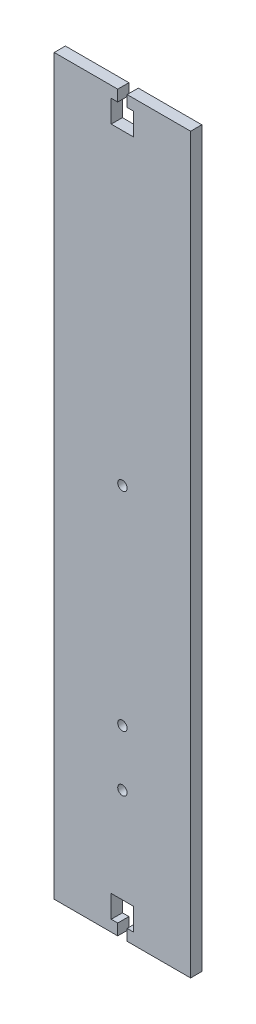
ISO-10303-21;
HEADER;
FILE_DESCRIPTION(('STEP AP214'),'2;1');
FILE_NAME('part.step','',(''),(''),'','','');
FILE_SCHEMA(('AUTOMOTIVE_DESIGN { 1 0 10303 214 1 1 1 1 }'));
ENDSEC;
DATA;
#1=APPLICATION_CONTEXT('core data for automotive mechanical design processes');
#2=APPLICATION_PROTOCOL_DEFINITION('international standard','automotive_design',2000,#1);
#3=PRODUCT_CONTEXT('',#1,'mechanical');
#4=PRODUCT('Part','Part','',(#3));
#5=PRODUCT_RELATED_PRODUCT_CATEGORY('part','',(#4));
#6=PRODUCT_DEFINITION_FORMATION('','',#4);
#7=PRODUCT_DEFINITION_CONTEXT('part definition',#1,'design');
#8=PRODUCT_DEFINITION('design','',#6,#7);
#9=PRODUCT_DEFINITION_SHAPE('','',#8);
#10=(LENGTH_UNIT() NAMED_UNIT(*) SI_UNIT(.MILLI.,.METRE.));
#11=(NAMED_UNIT(*) PLANE_ANGLE_UNIT() SI_UNIT($,.RADIAN.));
#12=(NAMED_UNIT(*) SI_UNIT($,.STERADIAN.) SOLID_ANGLE_UNIT());
#13=UNCERTAINTY_MEASURE_WITH_UNIT(LENGTH_MEASURE(1.E-05),#10,'distance_accuracy_value','');
#14=(GEOMETRIC_REPRESENTATION_CONTEXT(3) GLOBAL_UNCERTAINTY_ASSIGNED_CONTEXT((#13)) GLOBAL_UNIT_ASSIGNED_CONTEXT((#10,
#11,#12)) REPRESENTATION_CONTEXT('',''));
#15=CARTESIAN_POINT('',(0.,0.,0.));
#16=DIRECTION('',(0.,0.,1.));
#17=DIRECTION('',(1.,0.,0.));
#18=AXIS2_PLACEMENT_3D('',#15,#16,#17);
#19=CARTESIAN_POINT('',(30.505,-164.,5.));
#20=DIRECTION('',(0.,1.,0.));
#21=DIRECTION('',(-1.,0.,0.));
#22=AXIS2_PLACEMENT_3D('',#19,#20,#21);
#23=PLANE('',#22);
#24=DIRECTION('',(1.,0.,0.));
#25=VECTOR('',#24,1.);
#26=CARTESIAN_POINT('',(30.505,-164.,0.));
#27=LINE('',#26,#25);
#28=CARTESIAN_POINT('',(-30.505,-164.,0.));
#29=VERTEX_POINT('',#28);
#30=CARTESIAN_POINT('',(-2.1,-164.,0.));
#31=VERTEX_POINT('',#30);
#32=EDGE_CURVE('E215',#29,#31,#27,.T.);
#33=ORIENTED_EDGE('',*,*,#32,.T.);
#34=DIRECTION('',(0.,0.,1.));
#35=VECTOR('',#34,1.);
#36=CARTESIAN_POINT('',(-2.1,-164.,-5.));
#37=LINE('',#36,#35);
#38=CARTESIAN_POINT('',(-2.1,-164.,5.));
#39=VERTEX_POINT('',#38);
#40=EDGE_CURVE('E287',#31,#39,#37,.T.);
#41=ORIENTED_EDGE('',*,*,#40,.T.);
#42=DIRECTION('',(1.,0.,0.));
#43=VECTOR('',#42,1.);
#44=CARTESIAN_POINT('',(30.505,-164.,5.));
#45=LINE('',#44,#43);
#46=CARTESIAN_POINT('',(-30.505,-164.,5.));
#47=VERTEX_POINT('',#46);
#48=EDGE_CURVE('E194',#47,#39,#45,.T.);
#49=ORIENTED_EDGE('',*,*,#48,.F.);
#50=DIRECTION('',(0.,0.,-1.));
#51=VECTOR('',#50,1.);
#52=CARTESIAN_POINT('',(-30.505,-164.,5.));
#53=LINE('',#52,#51);
#54=EDGE_CURVE('E229',#47,#29,#53,.T.);
#55=ORIENTED_EDGE('',*,*,#54,.T.);
#56=EDGE_LOOP('',(#33,#41,#49,#55));
#57=FACE_BOUND('',#56,.T.);
#58=ADVANCED_FACE('F32',(#57),#23,.F.);
#59=CARTESIAN_POINT('',(30.505,164.,5.));
#60=DIRECTION('',(0.,-1.,0.));
#61=DIRECTION('',(1.,0.,0.));
#62=AXIS2_PLACEMENT_3D('',#59,#60,#61);
#63=PLANE('',#62);
#64=DIRECTION('',(-1.,0.,0.));
#65=VECTOR('',#64,1.);
#66=CARTESIAN_POINT('',(30.505,164.,0.));
#67=LINE('',#66,#65);
#68=CARTESIAN_POINT('',(30.505,164.,0.));
#69=VERTEX_POINT('',#68);
#70=CARTESIAN_POINT('',(2.10000000000003,164.,0.));
#71=VERTEX_POINT('',#70);
#72=EDGE_CURVE('E200',#69,#71,#67,.T.);
#73=ORIENTED_EDGE('',*,*,#72,.T.);
#74=DIRECTION('',(0.,0.,1.));
#75=VECTOR('',#74,1.);
#76=CARTESIAN_POINT('',(2.10000000000003,164.,-5.));
#77=LINE('',#76,#75);
#78=CARTESIAN_POINT('',(2.10000000000003,164.,5.));
#79=VERTEX_POINT('',#78);
#80=EDGE_CURVE('E188',#71,#79,#77,.T.);
#81=ORIENTED_EDGE('',*,*,#80,.T.);
#82=DIRECTION('',(-1.,0.,0.));
#83=VECTOR('',#82,1.);
#84=CARTESIAN_POINT('',(30.505,164.,5.));
#85=LINE('',#84,#83);
#86=CARTESIAN_POINT('',(30.505,164.,5.));
#87=VERTEX_POINT('',#86);
#88=EDGE_CURVE('E206',#87,#79,#85,.T.);
#89=ORIENTED_EDGE('',*,*,#88,.F.);
#90=DIRECTION('',(0.,0.,-1.));
#91=VECTOR('',#90,1.);
#92=CARTESIAN_POINT('',(30.505,164.,5.));
#93=LINE('',#92,#91);
#94=EDGE_CURVE('E225',#87,#69,#93,.T.);
#95=ORIENTED_EDGE('',*,*,#94,.T.);
#96=EDGE_LOOP('',(#73,#81,#89,#95));
#97=FACE_BOUND('',#96,.T.);
#98=ADVANCED_FACE('F386',(#97),#63,.F.);
#99=CARTESIAN_POINT('',(-30.505,-164.,5.));
#100=DIRECTION('',(1.,0.,0.));
#101=DIRECTION('',(0.,0.,-1.));
#102=AXIS2_PLACEMENT_3D('',#99,#100,#101);
#103=PLANE('',#102);
#104=DIRECTION('',(0.,-1.,0.));
#105=VECTOR('',#104,1.);
#106=CARTESIAN_POINT('',(-30.505,-164.,0.));
#107=LINE('',#106,#105);
#108=CARTESIAN_POINT('',(-30.505,164.,0.));
#109=VERTEX_POINT('',#108);
#110=EDGE_CURVE('E210',#109,#29,#107,.T.);
#111=ORIENTED_EDGE('',*,*,#110,.T.);
#112=ORIENTED_EDGE('',*,*,#54,.F.);
#113=DIRECTION('',(0.,-1.,0.));
#114=VECTOR('',#113,1.);
#115=CARTESIAN_POINT('',(-30.505,-164.,5.));
#116=LINE('',#115,#114);
#117=CARTESIAN_POINT('',(-30.505,164.,5.));
#118=VERTEX_POINT('',#117);
#119=EDGE_CURVE('E195',#118,#47,#116,.T.);
#120=ORIENTED_EDGE('',*,*,#119,.F.);
#121=DIRECTION('',(0.,0.,-1.));
#122=VECTOR('',#121,1.);
#123=CARTESIAN_POINT('',(-30.505,164.,5.));
#124=LINE('',#123,#122);
#125=EDGE_CURVE('E209',#118,#109,#124,.T.);
#126=ORIENTED_EDGE('',*,*,#125,.T.);
#127=EDGE_LOOP('',(#111,#112,#120,#126));
#128=FACE_BOUND('',#127,.T.);
#129=ADVANCED_FACE('F34',(#128),#103,.F.);
#130=CARTESIAN_POINT('',(2.10000000000003,-164.,5.));
#131=VERTEX_POINT('',#130);
#132=CARTESIAN_POINT('',(30.505,-164.,5.));
#133=VERTEX_POINT('',#132);
#134=EDGE_CURVE('E183',#131,#133,#45,.T.);
#135=ORIENTED_EDGE('',*,*,#134,.F.);
#136=DIRECTION('',(0.,0.,1.));
#137=VECTOR('',#136,1.);
#138=CARTESIAN_POINT('',(2.10000000000003,-164.,-5.));
#139=LINE('',#138,#137);
#140=CARTESIAN_POINT('',(2.10000000000003,-164.,0.));
#141=VERTEX_POINT('',#140);
#142=EDGE_CURVE('E167',#141,#131,#139,.T.);
#143=ORIENTED_EDGE('',*,*,#142,.F.);
#144=CARTESIAN_POINT('',(30.505,-164.,0.));
#145=VERTEX_POINT('',#144);
#146=EDGE_CURVE('E213',#141,#145,#27,.T.);
#147=ORIENTED_EDGE('',*,*,#146,.T.);
#148=DIRECTION('',(0.,0.,-1.));
#149=VECTOR('',#148,1.);
#150=CARTESIAN_POINT('',(30.505,-164.,5.));
#151=LINE('',#150,#149);
#152=EDGE_CURVE('E192',#133,#145,#151,.T.);
#153=ORIENTED_EDGE('',*,*,#152,.F.);
#154=EDGE_LOOP('',(#135,#143,#147,#153));
#155=FACE_BOUND('',#154,.T.);
#156=ADVANCED_FACE('F190',(#155),#23,.F.);
#157=CARTESIAN_POINT('',(30.505,-164.,5.));
#158=DIRECTION('',(-1.,0.,0.));
#159=DIRECTION('',(0.,0.,1.));
#160=AXIS2_PLACEMENT_3D('',#157,#158,#159);
#161=PLANE('',#160);
#162=DIRECTION('',(0.,1.,0.));
#163=VECTOR('',#162,1.);
#164=CARTESIAN_POINT('',(30.505,-164.,0.));
#165=LINE('',#164,#163);
#166=EDGE_CURVE('E218',#145,#69,#165,.T.);
#167=ORIENTED_EDGE('',*,*,#166,.T.);
#168=ORIENTED_EDGE('',*,*,#94,.F.);
#169=DIRECTION('',(0.,1.,0.));
#170=VECTOR('',#169,1.);
#171=CARTESIAN_POINT('',(30.505,-164.,5.));
#172=LINE('',#171,#170);
#173=EDGE_CURVE('E198',#133,#87,#172,.T.);
#174=ORIENTED_EDGE('',*,*,#173,.F.);
#175=ORIENTED_EDGE('',*,*,#152,.T.);
#176=EDGE_LOOP('',(#167,#168,#174,#175));
#177=FACE_BOUND('',#176,.T.);
#178=ADVANCED_FACE('F395',(#177),#161,.F.);
#179=CARTESIAN_POINT('',(-2.1,164.,5.));
#180=VERTEX_POINT('',#179);
#181=EDGE_CURVE('E205',#180,#118,#85,.T.);
#182=ORIENTED_EDGE('',*,*,#181,.F.);
#183=DIRECTION('',(0.,0.,1.));
#184=VECTOR('',#183,1.);
#185=CARTESIAN_POINT('',(-2.1,164.,-5.));
#186=LINE('',#185,#184);
#187=CARTESIAN_POINT('',(-2.1,164.,0.));
#188=VERTEX_POINT('',#187);
#189=EDGE_CURVE('E317',#188,#180,#186,.T.);
#190=ORIENTED_EDGE('',*,*,#189,.F.);
#191=EDGE_CURVE('E220',#188,#109,#67,.T.);
#192=ORIENTED_EDGE('',*,*,#191,.T.);
#193=ORIENTED_EDGE('',*,*,#125,.F.);
#194=EDGE_LOOP('',(#182,#190,#192,#193));
#195=FACE_BOUND('',#194,.T.);
#196=ADVANCED_FACE('F371',(#195),#63,.F.);
#197=CARTESIAN_POINT('',(0.,0.,5.));
#198=DIRECTION('',(0.,0.,1.));
#199=DIRECTION('',(1.,0.,0.));
#200=AXIS2_PLACEMENT_3D('',#197,#198,#199);
#201=PLANE('',#200);
#202=CARTESIAN_POINT('',(0.,11.5000000000001,5.));
#203=DIRECTION('',(0.,0.,1.));
#204=DIRECTION('',(1.,0.,0.));
#205=AXIS2_PLACEMENT_3D('',#202,#203,#204);
#206=CIRCLE('',#205,2.1);
#207=CARTESIAN_POINT('',(2.10000000000001,11.5000000000001,5.));
#208=VERTEX_POINT('',#207);
#209=EDGE_CURVE('E354',#208,#208,#206,.T.);
#210=ORIENTED_EDGE('',*,*,#209,.F.);
#211=EDGE_LOOP('',(#210));
#212=FACE_BOUND('',#211,.T.);
#213=CARTESIAN_POINT('',(0.,-106.5,5.));
#214=DIRECTION('',(0.,0.,1.));
#215=DIRECTION('',(1.,0.,0.));
#216=AXIS2_PLACEMENT_3D('',#213,#214,#215);
#217=CIRCLE('',#216,2.1);
#218=CARTESIAN_POINT('',(2.10000000000002,-106.5,5.));
#219=VERTEX_POINT('',#218);
#220=EDGE_CURVE('E348',#219,#219,#217,.T.);
#221=ORIENTED_EDGE('',*,*,#220,.F.);
#222=EDGE_LOOP('',(#221));
#223=FACE_BOUND('',#222,.T.);
#224=DIRECTION('',(0.,-1.,0.));
#225=VECTOR('',#224,1.);
#226=CARTESIAN_POINT('',(-2.1,-164.,5.));
#227=LINE('',#226,#225);
#228=CARTESIAN_POINT('',(-2.1,-159.,5.));
#229=VERTEX_POINT('',#228);
#230=EDGE_CURVE('E177',#229,#39,#227,.T.);
#231=ORIENTED_EDGE('',*,*,#230,.F.);
#232=DIRECTION('',(1.,0.,0.));
#233=VECTOR('',#232,1.);
#234=CARTESIAN_POINT('',(-2.1,-159.,5.));
#235=LINE('',#234,#233);
#236=CARTESIAN_POINT('',(-5.,-159.,5.));
#237=VERTEX_POINT('',#236);
#238=EDGE_CURVE('E338',#237,#229,#235,.T.);
#239=ORIENTED_EDGE('',*,*,#238,.F.);
#240=DIRECTION('',(0.,-1.,0.));
#241=VECTOR('',#240,1.);
#242=CARTESIAN_POINT('',(-5.,-159.,5.));
#243=LINE('',#242,#241);
#244=CARTESIAN_POINT('',(-5.,-149.,5.));
#245=VERTEX_POINT('',#244);
#246=EDGE_CURVE('E283',#245,#237,#243,.T.);
#247=ORIENTED_EDGE('',*,*,#246,.F.);
#248=DIRECTION('',(-1.,0.,0.));
#249=VECTOR('',#248,1.);
#250=CARTESIAN_POINT('',(-5.,-149.,5.));
#251=LINE('',#250,#249);
#252=CARTESIAN_POINT('',(5.00000000000001,-149.,5.));
#253=VERTEX_POINT('',#252);
#254=EDGE_CURVE('E341',#253,#245,#251,.T.);
#255=ORIENTED_EDGE('',*,*,#254,.F.);
#256=DIRECTION('',(0.,1.,0.));
#257=VECTOR('',#256,1.);
#258=CARTESIAN_POINT('',(5.00000000000002,-159.,5.));
#259=LINE('',#258,#257);
#260=CARTESIAN_POINT('',(5.00000000000002,-159.,5.));
#261=VERTEX_POINT('',#260);
#262=EDGE_CURVE('E344',#261,#253,#259,.T.);
#263=ORIENTED_EDGE('',*,*,#262,.F.);
#264=DIRECTION('',(1.,0.,0.));
#265=VECTOR('',#264,1.);
#266=CARTESIAN_POINT('',(2.10000000000002,-159.,5.));
#267=LINE('',#266,#265);
#268=CARTESIAN_POINT('',(2.10000000000002,-159.,5.));
#269=VERTEX_POINT('',#268);
#270=EDGE_CURVE('E187',#269,#261,#267,.T.);
#271=ORIENTED_EDGE('',*,*,#270,.F.);
#272=DIRECTION('',(0.,1.,0.));
#273=VECTOR('',#272,1.);
#274=CARTESIAN_POINT('',(2.10000000000003,-164.,5.));
#275=LINE('',#274,#273);
#276=EDGE_CURVE('E170',#131,#269,#275,.T.);
#277=ORIENTED_EDGE('',*,*,#276,.F.);
#278=ORIENTED_EDGE('',*,*,#134,.T.);
#279=ORIENTED_EDGE('',*,*,#173,.T.);
#280=ORIENTED_EDGE('',*,*,#88,.T.);
#281=DIRECTION('',(0.,1.,0.));
#282=VECTOR('',#281,1.);
#283=CARTESIAN_POINT('',(2.10000000000003,164.,5.));
#284=LINE('',#283,#282);
#285=CARTESIAN_POINT('',(2.10000000000002,159.,5.));
#286=VERTEX_POINT('',#285);
#287=EDGE_CURVE('E315',#286,#79,#284,.T.);
#288=ORIENTED_EDGE('',*,*,#287,.F.);
#289=DIRECTION('',(-1.,0.,0.));
#290=VECTOR('',#289,1.);
#291=CARTESIAN_POINT('',(2.10000000000002,159.,5.));
#292=LINE('',#291,#290);
#293=CARTESIAN_POINT('',(5.00000000000002,159.,5.));
#294=VERTEX_POINT('',#293);
#295=EDGE_CURVE('E312',#294,#286,#292,.T.);
#296=ORIENTED_EDGE('',*,*,#295,.F.);
#297=DIRECTION('',(0.,1.,0.));
#298=VECTOR('',#297,1.);
#299=CARTESIAN_POINT('',(5.00000000000002,159.,5.));
#300=LINE('',#299,#298);
#301=CARTESIAN_POINT('',(5.00000000000001,149.,5.));
#302=VERTEX_POINT('',#301);
#303=EDGE_CURVE('E309',#302,#294,#300,.T.);
#304=ORIENTED_EDGE('',*,*,#303,.F.);
#305=DIRECTION('',(1.,0.,0.));
#306=VECTOR('',#305,1.);
#307=CARTESIAN_POINT('',(-5.,149.,5.));
#308=LINE('',#307,#306);
#309=CARTESIAN_POINT('',(-5.,149.,5.));
#310=VERTEX_POINT('',#309);
#311=EDGE_CURVE('E306',#310,#302,#308,.T.);
#312=ORIENTED_EDGE('',*,*,#311,.F.);
#313=DIRECTION('',(0.,-1.,0.));
#314=VECTOR('',#313,1.);
#315=CARTESIAN_POINT('',(-5.,159.,5.));
#316=LINE('',#315,#314);
#317=CARTESIAN_POINT('',(-5.,159.,5.));
#318=VERTEX_POINT('',#317);
#319=EDGE_CURVE('E303',#318,#310,#316,.T.);
#320=ORIENTED_EDGE('',*,*,#319,.F.);
#321=DIRECTION('',(-1.,0.,0.));
#322=VECTOR('',#321,1.);
#323=CARTESIAN_POINT('',(-2.1,159.,5.));
#324=LINE('',#323,#322);
#325=CARTESIAN_POINT('',(-2.1,159.,5.));
#326=VERTEX_POINT('',#325);
#327=EDGE_CURVE('E299',#326,#318,#324,.T.);
#328=ORIENTED_EDGE('',*,*,#327,.F.);
#329=DIRECTION('',(0.,-1.,0.));
#330=VECTOR('',#329,1.);
#331=CARTESIAN_POINT('',(-2.1,164.,5.));
#332=LINE('',#331,#330);
#333=EDGE_CURVE('E297',#180,#326,#332,.T.);
#334=ORIENTED_EDGE('',*,*,#333,.F.);
#335=ORIENTED_EDGE('',*,*,#181,.T.);
#336=ORIENTED_EDGE('',*,*,#119,.T.);
#337=ORIENTED_EDGE('',*,*,#48,.T.);
#338=EDGE_LOOP('',(#231,#239,#247,#255,#263,#271,#277,#278,#279,#280,#288,#296,#304,#312,#320,
#328,#334,#335,#336,#337));
#339=FACE_BOUND('',#338,.T.);
#340=CARTESIAN_POINT('',(0.,-81.5,5.));
#341=DIRECTION('',(0.,0.,1.));
#342=DIRECTION('',(1.,0.,0.));
#343=AXIS2_PLACEMENT_3D('',#340,#341,#342);
#344=CIRCLE('',#343,2.1);
#345=CARTESIAN_POINT('',(2.10000000000002,-81.5,5.));
#346=VERTEX_POINT('',#345);
#347=EDGE_CURVE('E235',#346,#346,#344,.T.);
#348=ORIENTED_EDGE('',*,*,#347,.F.);
#349=EDGE_LOOP('',(#348));
#350=FACE_BOUND('',#349,.T.);
#351=ADVANCED_FACE('F181',(#212,#223,#339,#350),#201,.T.);
#352=CARTESIAN_POINT('',(0.,0.,0.));
#353=DIRECTION('',(0.,0.,1.));
#354=DIRECTION('',(1.,0.,0.));
#355=AXIS2_PLACEMENT_3D('',#352,#353,#354);
#356=PLANE('',#355);
#357=CARTESIAN_POINT('',(0.,11.5000000000001,0.));
#358=DIRECTION('',(0.,0.,1.));
#359=DIRECTION('',(1.,0.,0.));
#360=AXIS2_PLACEMENT_3D('',#357,#358,#359);
#361=CIRCLE('',#360,2.1);
#362=CARTESIAN_POINT('',(2.10000000000001,11.5000000000001,0.));
#363=VERTEX_POINT('',#362);
#364=EDGE_CURVE('E351',#363,#363,#361,.T.);
#365=ORIENTED_EDGE('',*,*,#364,.T.);
#366=EDGE_LOOP('',(#365));
#367=FACE_BOUND('',#366,.T.);
#368=CARTESIAN_POINT('',(0.,-106.5,0.));
#369=DIRECTION('',(0.,0.,1.));
#370=DIRECTION('',(1.,0.,0.));
#371=AXIS2_PLACEMENT_3D('',#368,#369,#370);
#372=CIRCLE('',#371,2.1);
#373=CARTESIAN_POINT('',(2.10000000000002,-106.5,0.));
#374=VERTEX_POINT('',#373);
#375=EDGE_CURVE('E300',#374,#374,#372,.T.);
#376=ORIENTED_EDGE('',*,*,#375,.T.);
#377=EDGE_LOOP('',(#376));
#378=FACE_BOUND('',#377,.T.);
#379=CARTESIAN_POINT('',(0.,-81.5,0.));
#380=DIRECTION('',(0.,0.,1.));
#381=DIRECTION('',(1.,0.,0.));
#382=AXIS2_PLACEMENT_3D('',#379,#380,#381);
#383=CIRCLE('',#382,2.1);
#384=CARTESIAN_POINT('',(2.10000000000002,-81.5,0.));
#385=VERTEX_POINT('',#384);
#386=EDGE_CURVE('E214',#385,#385,#383,.T.);
#387=ORIENTED_EDGE('',*,*,#386,.T.);
#388=EDGE_LOOP('',(#387));
#389=FACE_BOUND('',#388,.T.);
#390=DIRECTION('',(1.,0.,0.));
#391=VECTOR('',#390,1.);
#392=CARTESIAN_POINT('',(0.,-159.,0.));
#393=LINE('',#392,#391);
#394=CARTESIAN_POINT('',(-5.,-159.,0.));
#395=VERTEX_POINT('',#394);
#396=CARTESIAN_POINT('',(-2.1,-159.,0.));
#397=VERTEX_POINT('',#396);
#398=EDGE_CURVE('E40',#395,#397,#393,.T.);
#399=ORIENTED_EDGE('',*,*,#398,.T.);
#400=DIRECTION('',(0.,-1.,0.));
#401=VECTOR('',#400,1.);
#402=CARTESIAN_POINT('',(-2.09999999999997,0.,0.));
#403=LINE('',#402,#401);
#404=EDGE_CURVE('E11',#397,#31,#403,.T.);
#405=ORIENTED_EDGE('',*,*,#404,.T.);
#406=ORIENTED_EDGE('',*,*,#32,.F.);
#407=ORIENTED_EDGE('',*,*,#110,.F.);
#408=ORIENTED_EDGE('',*,*,#191,.F.);
#409=DIRECTION('',(0.,-1.,0.));
#410=VECTOR('',#409,1.);
#411=CARTESIAN_POINT('',(-2.09999999999997,0.,0.));
#412=LINE('',#411,#410);
#413=CARTESIAN_POINT('',(-2.1,159.,0.));
#414=VERTEX_POINT('',#413);
#415=EDGE_CURVE('E232',#188,#414,#412,.T.);
#416=ORIENTED_EDGE('',*,*,#415,.T.);
#417=DIRECTION('',(-1.,0.,0.));
#418=VECTOR('',#417,1.);
#419=CARTESIAN_POINT('',(0.,159.,0.));
#420=LINE('',#419,#418);
#421=CARTESIAN_POINT('',(-5.,159.,0.));
#422=VERTEX_POINT('',#421);
#423=EDGE_CURVE('E238',#414,#422,#420,.T.);
#424=ORIENTED_EDGE('',*,*,#423,.T.);
#425=DIRECTION('',(0.,-1.,0.));
#426=VECTOR('',#425,1.);
#427=CARTESIAN_POINT('',(-4.99999999999999,0.,0.));
#428=LINE('',#427,#426);
#429=CARTESIAN_POINT('',(-5.,149.,0.));
#430=VERTEX_POINT('',#429);
#431=EDGE_CURVE('E241',#422,#430,#428,.T.);
#432=ORIENTED_EDGE('',*,*,#431,.T.);
#433=DIRECTION('',(1.,0.,0.));
#434=VECTOR('',#433,1.);
#435=CARTESIAN_POINT('',(0.,149.,0.));
#436=LINE('',#435,#434);
#437=CARTESIAN_POINT('',(5.00000000000001,149.,0.));
#438=VERTEX_POINT('',#437);
#439=EDGE_CURVE('E244',#430,#438,#436,.T.);
#440=ORIENTED_EDGE('',*,*,#439,.T.);
#441=DIRECTION('',(0.,1.,0.));
#442=VECTOR('',#441,1.);
#443=CARTESIAN_POINT('',(4.99999999999982,0.,0.));
#444=LINE('',#443,#442);
#445=CARTESIAN_POINT('',(5.00000000000002,159.,0.));
#446=VERTEX_POINT('',#445);
#447=EDGE_CURVE('E247',#438,#446,#444,.T.);
#448=ORIENTED_EDGE('',*,*,#447,.T.);
#449=DIRECTION('',(-1.,0.,0.));
#450=VECTOR('',#449,1.);
#451=CARTESIAN_POINT('',(0.,159.,0.));
#452=LINE('',#451,#450);
#453=CARTESIAN_POINT('',(2.10000000000002,159.,0.));
#454=VERTEX_POINT('',#453);
#455=EDGE_CURVE('E250',#446,#454,#452,.T.);
#456=ORIENTED_EDGE('',*,*,#455,.T.);
#457=DIRECTION('',(0.,1.,0.));
#458=VECTOR('',#457,1.);
#459=CARTESIAN_POINT('',(2.0999999999998,0.,0.));
#460=LINE('',#459,#458);
#461=EDGE_CURVE('E253',#454,#71,#460,.T.);
#462=ORIENTED_EDGE('',*,*,#461,.T.);
#463=ORIENTED_EDGE('',*,*,#72,.F.);
#464=ORIENTED_EDGE('',*,*,#166,.F.);
#465=ORIENTED_EDGE('',*,*,#146,.F.);
#466=DIRECTION('',(0.,1.,0.));
#467=VECTOR('',#466,1.);
#468=CARTESIAN_POINT('',(2.0999999999998,0.,0.));
#469=LINE('',#468,#467);
#470=CARTESIAN_POINT('',(2.10000000000002,-159.,0.));
#471=VERTEX_POINT('',#470);
#472=EDGE_CURVE('E173',#141,#471,#469,.T.);
#473=ORIENTED_EDGE('',*,*,#472,.T.);
#474=DIRECTION('',(1.,0.,0.));
#475=VECTOR('',#474,1.);
#476=CARTESIAN_POINT('',(0.,-159.,0.));
#477=LINE('',#476,#475);
#478=CARTESIAN_POINT('',(5.00000000000002,-159.,0.));
#479=VERTEX_POINT('',#478);
#480=EDGE_CURVE('E257',#471,#479,#477,.T.);
#481=ORIENTED_EDGE('',*,*,#480,.T.);
#482=DIRECTION('',(0.,1.,0.));
#483=VECTOR('',#482,1.);
#484=CARTESIAN_POINT('',(4.99999999999982,0.,0.));
#485=LINE('',#484,#483);
#486=CARTESIAN_POINT('',(5.00000000000001,-149.,0.));
#487=VERTEX_POINT('',#486);
#488=EDGE_CURVE('E260',#479,#487,#485,.T.);
#489=ORIENTED_EDGE('',*,*,#488,.T.);
#490=DIRECTION('',(-1.,0.,0.));
#491=VECTOR('',#490,1.);
#492=CARTESIAN_POINT('',(0.,-149.,0.));
#493=LINE('',#492,#491);
#494=CARTESIAN_POINT('',(-5.,-149.,0.));
#495=VERTEX_POINT('',#494);
#496=EDGE_CURVE('E263',#487,#495,#493,.T.);
#497=ORIENTED_EDGE('',*,*,#496,.T.);
#498=DIRECTION('',(0.,-1.,0.));
#499=VECTOR('',#498,1.);
#500=CARTESIAN_POINT('',(-4.99999999999999,0.,0.));
#501=LINE('',#500,#499);
#502=EDGE_CURVE('E266',#495,#395,#501,.T.);
#503=ORIENTED_EDGE('',*,*,#502,.T.);
#504=EDGE_LOOP('',(#399,#405,#406,#407,#408,#416,#424,#432,#440,#448,#456,#462,#463,#464,#465,
#473,#481,#489,#497,#503));
#505=FACE_BOUND('',#504,.T.);
#506=ADVANCED_FACE('F270',(#367,#378,#389,#505),#356,.F.);
#507=CARTESIAN_POINT('',(0.,-81.5,-5.));
#508=DIRECTION('',(0.,0.,1.));
#509=DIRECTION('',(1.,0.,0.));
#510=AXIS2_PLACEMENT_3D('',#507,#508,#509);
#511=CYLINDRICAL_SURFACE('',#510,2.1);
#512=ORIENTED_EDGE('',*,*,#347,.T.);
#513=EDGE_LOOP('',(#512));
#514=FACE_BOUND('',#513,.T.);
#515=ORIENTED_EDGE('',*,*,#386,.F.);
#516=EDGE_LOOP('',(#515));
#517=FACE_BOUND('',#516,.T.);
#518=ADVANCED_FACE('F470',(#514,#517),#511,.F.);
#519=CARTESIAN_POINT('',(2.10000000000003,164.,-5.));
#520=DIRECTION('',(1.,0.,0.));
#521=DIRECTION('',(0.,1.,0.));
#522=AXIS2_PLACEMENT_3D('',#519,#520,#521);
#523=PLANE('',#522);
#524=DIRECTION('',(0.,0.,1.));
#525=VECTOR('',#524,1.);
#526=CARTESIAN_POINT('',(2.10000000000002,159.,-5.));
#527=LINE('',#526,#525);
#528=EDGE_CURVE('E320',#454,#286,#527,.T.);
#529=ORIENTED_EDGE('',*,*,#528,.T.);
#530=ORIENTED_EDGE('',*,*,#287,.T.);
#531=ORIENTED_EDGE('',*,*,#80,.F.);
#532=ORIENTED_EDGE('',*,*,#461,.F.);
#533=EDGE_LOOP('',(#529,#530,#531,#532));
#534=FACE_BOUND('',#533,.T.);
#535=ADVANCED_FACE('F437',(#534),#523,.F.);
#536=CARTESIAN_POINT('',(2.10000000000002,159.,-5.));
#537=DIRECTION('',(0.,1.,0.));
#538=DIRECTION('',(0.,0.,1.));
#539=AXIS2_PLACEMENT_3D('',#536,#537,#538);
#540=PLANE('',#539);
#541=DIRECTION('',(0.,0.,1.));
#542=VECTOR('',#541,1.);
#543=CARTESIAN_POINT('',(5.00000000000002,159.,-5.));
#544=LINE('',#543,#542);
#545=EDGE_CURVE('E322',#446,#294,#544,.T.);
#546=ORIENTED_EDGE('',*,*,#545,.T.);
#547=ORIENTED_EDGE('',*,*,#295,.T.);
#548=ORIENTED_EDGE('',*,*,#528,.F.);
#549=ORIENTED_EDGE('',*,*,#455,.F.);
#550=EDGE_LOOP('',(#546,#547,#548,#549));
#551=FACE_BOUND('',#550,.T.);
#552=ADVANCED_FACE('F433',(#551),#540,.F.);
#553=CARTESIAN_POINT('',(5.00000000000002,159.,-5.));
#554=DIRECTION('',(1.,0.,0.));
#555=DIRECTION('',(0.,1.,0.));
#556=AXIS2_PLACEMENT_3D('',#553,#554,#555);
#557=PLANE('',#556);
#558=DIRECTION('',(0.,0.,1.));
#559=VECTOR('',#558,1.);
#560=CARTESIAN_POINT('',(5.00000000000001,149.,-5.));
#561=LINE('',#560,#559);
#562=EDGE_CURVE('E324',#438,#302,#561,.T.);
#563=ORIENTED_EDGE('',*,*,#562,.T.);
#564=ORIENTED_EDGE('',*,*,#303,.T.);
#565=ORIENTED_EDGE('',*,*,#545,.F.);
#566=ORIENTED_EDGE('',*,*,#447,.F.);
#567=EDGE_LOOP('',(#563,#564,#565,#566));
#568=FACE_BOUND('',#567,.T.);
#569=ADVANCED_FACE('F430',(#568),#557,.F.);
#570=CARTESIAN_POINT('',(-5.,149.,-5.));
#571=DIRECTION('',(0.,-1.,0.));
#572=DIRECTION('',(0.,0.,-1.));
#573=AXIS2_PLACEMENT_3D('',#570,#571,#572);
#574=PLANE('',#573);
#575=DIRECTION('',(0.,0.,1.));
#576=VECTOR('',#575,1.);
#577=CARTESIAN_POINT('',(-5.,149.,-5.));
#578=LINE('',#577,#576);
#579=EDGE_CURVE('E326',#430,#310,#578,.T.);
#580=ORIENTED_EDGE('',*,*,#579,.T.);
#581=ORIENTED_EDGE('',*,*,#311,.T.);
#582=ORIENTED_EDGE('',*,*,#562,.F.);
#583=ORIENTED_EDGE('',*,*,#439,.F.);
#584=EDGE_LOOP('',(#580,#581,#582,#583));
#585=FACE_BOUND('',#584,.T.);
#586=ADVANCED_FACE('F425',(#585),#574,.F.);
#587=CARTESIAN_POINT('',(-5.,159.,-5.));
#588=DIRECTION('',(-1.,0.,0.));
#589=DIRECTION('',(0.,-1.,0.));
#590=AXIS2_PLACEMENT_3D('',#587,#588,#589);
#591=PLANE('',#590);
#592=DIRECTION('',(0.,0.,1.));
#593=VECTOR('',#592,1.);
#594=CARTESIAN_POINT('',(-5.,159.,-5.));
#595=LINE('',#594,#593);
#596=EDGE_CURVE('E328',#422,#318,#595,.T.);
#597=ORIENTED_EDGE('',*,*,#596,.T.);
#598=ORIENTED_EDGE('',*,*,#319,.T.);
#599=ORIENTED_EDGE('',*,*,#579,.F.);
#600=ORIENTED_EDGE('',*,*,#431,.F.);
#601=EDGE_LOOP('',(#597,#598,#599,#600));
#602=FACE_BOUND('',#601,.T.);
#603=ADVANCED_FACE('F421',(#602),#591,.F.);
#604=CARTESIAN_POINT('',(-2.1,159.,-5.));
#605=DIRECTION('',(0.,1.,0.));
#606=DIRECTION('',(0.,0.,1.));
#607=AXIS2_PLACEMENT_3D('',#604,#605,#606);
#608=PLANE('',#607);
#609=DIRECTION('',(0.,0.,1.));
#610=VECTOR('',#609,1.);
#611=CARTESIAN_POINT('',(-2.1,159.,-5.));
#612=LINE('',#611,#610);
#613=EDGE_CURVE('E55',#414,#326,#612,.T.);
#614=ORIENTED_EDGE('',*,*,#613,.T.);
#615=ORIENTED_EDGE('',*,*,#327,.T.);
#616=ORIENTED_EDGE('',*,*,#596,.F.);
#617=ORIENTED_EDGE('',*,*,#423,.F.);
#618=EDGE_LOOP('',(#614,#615,#616,#617));
#619=FACE_BOUND('',#618,.T.);
#620=ADVANCED_FACE('F418',(#619),#608,.F.);
#621=CARTESIAN_POINT('',(-2.1,164.,-5.));
#622=DIRECTION('',(-1.,0.,0.));
#623=DIRECTION('',(0.,-1.,0.));
#624=AXIS2_PLACEMENT_3D('',#621,#622,#623);
#625=PLANE('',#624);
#626=ORIENTED_EDGE('',*,*,#189,.T.);
#627=ORIENTED_EDGE('',*,*,#333,.T.);
#628=ORIENTED_EDGE('',*,*,#613,.F.);
#629=ORIENTED_EDGE('',*,*,#415,.F.);
#630=EDGE_LOOP('',(#626,#627,#628,#629));
#631=FACE_BOUND('',#630,.T.);
#632=ADVANCED_FACE('F415',(#631),#625,.F.);
#633=CARTESIAN_POINT('',(-2.1,-164.,-5.));
#634=DIRECTION('',(-1.,0.,0.));
#635=DIRECTION('',(0.,-1.,0.));
#636=AXIS2_PLACEMENT_3D('',#633,#634,#635);
#637=PLANE('',#636);
#638=DIRECTION('',(0.,0.,1.));
#639=VECTOR('',#638,1.);
#640=CARTESIAN_POINT('',(-2.1,-159.,-5.));
#641=LINE('',#640,#639);
#642=EDGE_CURVE('E278',#397,#229,#641,.T.);
#643=ORIENTED_EDGE('',*,*,#642,.T.);
#644=ORIENTED_EDGE('',*,*,#230,.T.);
#645=ORIENTED_EDGE('',*,*,#40,.F.);
#646=ORIENTED_EDGE('',*,*,#404,.F.);
#647=EDGE_LOOP('',(#643,#644,#645,#646));
#648=FACE_BOUND('',#647,.T.);
#649=ADVANCED_FACE('F451',(#648),#637,.F.);
#650=CARTESIAN_POINT('',(-2.1,-159.,-5.));
#651=DIRECTION('',(0.,-1.,0.));
#652=DIRECTION('',(0.,0.,-1.));
#653=AXIS2_PLACEMENT_3D('',#650,#651,#652);
#654=PLANE('',#653);
#655=DIRECTION('',(0.,0.,1.));
#656=VECTOR('',#655,1.);
#657=CARTESIAN_POINT('',(-5.,-159.,-5.));
#658=LINE('',#657,#656);
#659=EDGE_CURVE('E276',#395,#237,#658,.T.);
#660=ORIENTED_EDGE('',*,*,#659,.T.);
#661=ORIENTED_EDGE('',*,*,#238,.T.);
#662=ORIENTED_EDGE('',*,*,#642,.F.);
#663=ORIENTED_EDGE('',*,*,#398,.F.);
#664=EDGE_LOOP('',(#660,#661,#662,#663));
#665=FACE_BOUND('',#664,.T.);
#666=ADVANCED_FACE('F274',(#665),#654,.F.);
#667=CARTESIAN_POINT('',(-5.,-159.,-5.));
#668=DIRECTION('',(-1.,0.,0.));
#669=DIRECTION('',(0.,-1.,0.));
#670=AXIS2_PLACEMENT_3D('',#667,#668,#669);
#671=PLANE('',#670);
#672=DIRECTION('',(0.,0.,1.));
#673=VECTOR('',#672,1.);
#674=CARTESIAN_POINT('',(-5.,-149.,-5.));
#675=LINE('',#674,#673);
#676=EDGE_CURVE('E285',#495,#245,#675,.T.);
#677=ORIENTED_EDGE('',*,*,#676,.T.);
#678=ORIENTED_EDGE('',*,*,#246,.T.);
#679=ORIENTED_EDGE('',*,*,#659,.F.);
#680=ORIENTED_EDGE('',*,*,#502,.F.);
#681=EDGE_LOOP('',(#677,#678,#679,#680));
#682=FACE_BOUND('',#681,.T.);
#683=ADVANCED_FACE('F280',(#682),#671,.F.);
#684=CARTESIAN_POINT('',(-5.,-149.,-5.));
#685=DIRECTION('',(0.,1.,0.));
#686=DIRECTION('',(0.,0.,1.));
#687=AXIS2_PLACEMENT_3D('',#684,#685,#686);
#688=PLANE('',#687);
#689=DIRECTION('',(0.,0.,1.));
#690=VECTOR('',#689,1.);
#691=CARTESIAN_POINT('',(5.00000000000001,-149.,-5.));
#692=LINE('',#691,#690);
#693=EDGE_CURVE('E289',#487,#253,#692,.T.);
#694=ORIENTED_EDGE('',*,*,#693,.T.);
#695=ORIENTED_EDGE('',*,*,#254,.T.);
#696=ORIENTED_EDGE('',*,*,#676,.F.);
#697=ORIENTED_EDGE('',*,*,#496,.F.);
#698=EDGE_LOOP('',(#694,#695,#696,#697));
#699=FACE_BOUND('',#698,.T.);
#700=ADVANCED_FACE('F449',(#699),#688,.F.);
#701=CARTESIAN_POINT('',(5.00000000000002,-159.,-5.));
#702=DIRECTION('',(1.,0.,0.));
#703=DIRECTION('',(0.,1.,0.));
#704=AXIS2_PLACEMENT_3D('',#701,#702,#703);
#705=PLANE('',#704);
#706=DIRECTION('',(0.,0.,1.));
#707=VECTOR('',#706,1.);
#708=CARTESIAN_POINT('',(5.00000000000002,-159.,-5.));
#709=LINE('',#708,#707);
#710=EDGE_CURVE('E294',#479,#261,#709,.T.);
#711=ORIENTED_EDGE('',*,*,#710,.T.);
#712=ORIENTED_EDGE('',*,*,#262,.T.);
#713=ORIENTED_EDGE('',*,*,#693,.F.);
#714=ORIENTED_EDGE('',*,*,#488,.F.);
#715=EDGE_LOOP('',(#711,#712,#713,#714));
#716=FACE_BOUND('',#715,.T.);
#717=ADVANCED_FACE('F445',(#716),#705,.F.);
#718=CARTESIAN_POINT('',(2.10000000000002,-159.,-5.));
#719=DIRECTION('',(0.,-1.,0.));
#720=DIRECTION('',(0.,0.,-1.));
#721=AXIS2_PLACEMENT_3D('',#718,#719,#720);
#722=PLANE('',#721);
#723=DIRECTION('',(0.,0.,1.));
#724=VECTOR('',#723,1.);
#725=CARTESIAN_POINT('',(2.10000000000002,-159.,-5.));
#726=LINE('',#725,#724);
#727=EDGE_CURVE('E47',#471,#269,#726,.T.);
#728=ORIENTED_EDGE('',*,*,#727,.T.);
#729=ORIENTED_EDGE('',*,*,#270,.T.);
#730=ORIENTED_EDGE('',*,*,#710,.F.);
#731=ORIENTED_EDGE('',*,*,#480,.F.);
#732=EDGE_LOOP('',(#728,#729,#730,#731));
#733=FACE_BOUND('',#732,.T.);
#734=ADVANCED_FACE('F381',(#733),#722,.F.);
#735=CARTESIAN_POINT('',(2.10000000000003,-164.,-5.));
#736=DIRECTION('',(1.,0.,0.));
#737=DIRECTION('',(0.,1.,0.));
#738=AXIS2_PLACEMENT_3D('',#735,#736,#737);
#739=PLANE('',#738);
#740=ORIENTED_EDGE('',*,*,#142,.T.);
#741=ORIENTED_EDGE('',*,*,#276,.T.);
#742=ORIENTED_EDGE('',*,*,#727,.F.);
#743=ORIENTED_EDGE('',*,*,#472,.F.);
#744=EDGE_LOOP('',(#740,#741,#742,#743));
#745=FACE_BOUND('',#744,.T.);
#746=ADVANCED_FACE('F169',(#745),#739,.F.);
#747=CARTESIAN_POINT('',(0.,-106.5,0.));
#748=DIRECTION('',(0.,0.,1.));
#749=DIRECTION('',(1.,0.,0.));
#750=AXIS2_PLACEMENT_3D('',#747,#748,#749);
#751=CYLINDRICAL_SURFACE('',#750,2.1);
#752=ORIENTED_EDGE('',*,*,#375,.F.);
#753=EDGE_LOOP('',(#752));
#754=FACE_BOUND('',#753,.T.);
#755=ORIENTED_EDGE('',*,*,#220,.T.);
#756=EDGE_LOOP('',(#755));
#757=FACE_BOUND('',#756,.T.);
#758=ADVANCED_FACE('F365',(#754,#757),#751,.F.);
#759=CARTESIAN_POINT('',(0.,11.5000000000001,0.));
#760=DIRECTION('',(0.,0.,1.));
#761=DIRECTION('',(1.,0.,0.));
#762=AXIS2_PLACEMENT_3D('',#759,#760,#761);
#763=CYLINDRICAL_SURFACE('',#762,2.1);
#764=ORIENTED_EDGE('',*,*,#364,.F.);
#765=EDGE_LOOP('',(#764));
#766=FACE_BOUND('',#765,.T.);
#767=ORIENTED_EDGE('',*,*,#209,.T.);
#768=EDGE_LOOP('',(#767));
#769=FACE_BOUND('',#768,.T.);
#770=ADVANCED_FACE('F362',(#766,#769),#763,.F.);
#771=CLOSED_SHELL('',(#58,#98,#129,#156,#178,#196,#351,#506,#518,#535,#552,#569,#586,#603,#620,
#632,#649,#666,#683,#700,#717,#734,#746,#758,#770));
#772=MANIFOLD_SOLID_BREP('B2',#771);
#773=ADVANCED_BREP_SHAPE_REPRESENTATION('',(#18,#772),#14);
#774=SHAPE_DEFINITION_REPRESENTATION(#9,#773);
ENDSEC;
END-ISO-10303-21;
